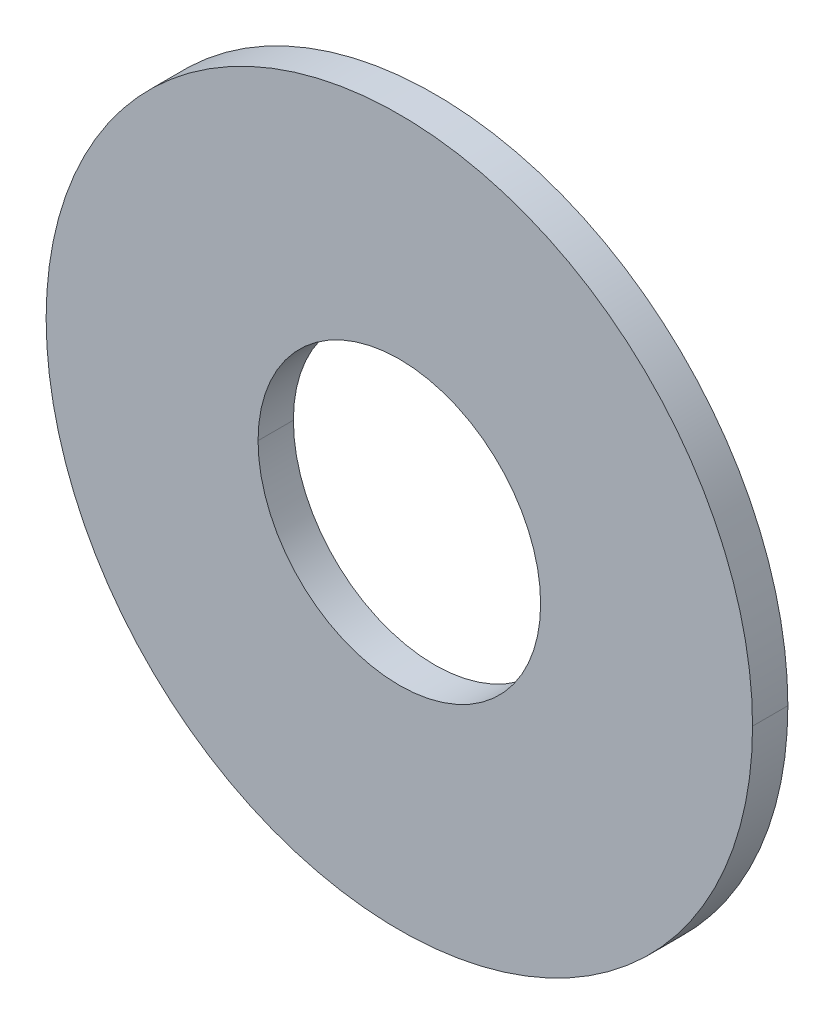
ISO-10303-21;
HEADER;
FILE_DESCRIPTION(('STEP AP214'),'2;1');
FILE_NAME('part.step','',(''),(''),'','','');
FILE_SCHEMA(('AUTOMOTIVE_DESIGN { 1 0 10303 214 1 1 1 1 }'));
ENDSEC;
DATA;
#1=APPLICATION_CONTEXT('core data for automotive mechanical design processes');
#2=APPLICATION_PROTOCOL_DEFINITION('international standard','automotive_design',2000,#1);
#3=PRODUCT_CONTEXT('',#1,'mechanical');
#4=PRODUCT('Part','Part','',(#3));
#5=PRODUCT_RELATED_PRODUCT_CATEGORY('part','',(#4));
#6=PRODUCT_DEFINITION_FORMATION('','',#4);
#7=PRODUCT_DEFINITION_CONTEXT('part definition',#1,'design');
#8=PRODUCT_DEFINITION('design','',#6,#7);
#9=PRODUCT_DEFINITION_SHAPE('','',#8);
#10=(LENGTH_UNIT() NAMED_UNIT(*) SI_UNIT(.MILLI.,.METRE.));
#11=(NAMED_UNIT(*) PLANE_ANGLE_UNIT() SI_UNIT($,.RADIAN.));
#12=(NAMED_UNIT(*) SI_UNIT($,.STERADIAN.) SOLID_ANGLE_UNIT());
#13=UNCERTAINTY_MEASURE_WITH_UNIT(LENGTH_MEASURE(1.E-05),#10,'distance_accuracy_value','');
#14=(GEOMETRIC_REPRESENTATION_CONTEXT(3) GLOBAL_UNCERTAINTY_ASSIGNED_CONTEXT((#13)) GLOBAL_UNIT_ASSIGNED_CONTEXT((#10,
#11,#12)) REPRESENTATION_CONTEXT('',''));
#15=CARTESIAN_POINT('',(0.,0.,0.));
#16=DIRECTION('',(0.,0.,1.));
#17=DIRECTION('',(1.,0.,0.));
#18=AXIS2_PLACEMENT_3D('',#15,#16,#17);
#19=CARTESIAN_POINT('',(0.,0.,1.));
#20=DIRECTION('',(0.,0.,-1.));
#21=DIRECTION('',(0.,1.,0.));
#22=AXIS2_PLACEMENT_3D('',#19,#20,#21);
#23=CYLINDRICAL_SURFACE('',#22,4.);
#24=DIRECTION('',(0.,0.,-1.));
#25=VECTOR('',#24,1.);
#26=CARTESIAN_POINT('',(4.,0.,1.));
#27=LINE('',#26,#25);
#28=CARTESIAN_POINT('',(4.,0.,1.));
#29=VERTEX_POINT('',#28);
#30=CARTESIAN_POINT('',(4.,0.,0.));
#31=VERTEX_POINT('',#30);
#32=EDGE_CURVE('E10',#29,#31,#27,.T.);
#33=ORIENTED_EDGE('',*,*,#32,.T.);
#34=CARTESIAN_POINT('',(0.,0.,0.));
#35=DIRECTION('',(0.,0.,1.));
#36=DIRECTION('',(1.,0.,0.));
#37=AXIS2_PLACEMENT_3D('',#34,#35,#36);
#38=CIRCLE('',#37,4.);
#39=CARTESIAN_POINT('',(-4.,0.,0.));
#40=VERTEX_POINT('',#39);
#41=EDGE_CURVE('E24',#40,#31,#38,.T.);
#42=ORIENTED_EDGE('',*,*,#41,.F.);
#43=DIRECTION('',(0.,0.,-1.));
#44=VECTOR('',#43,1.);
#45=CARTESIAN_POINT('',(-4.,0.,1.));
#46=LINE('',#45,#44);
#47=CARTESIAN_POINT('',(-4.,0.,1.));
#48=VERTEX_POINT('',#47);
#49=EDGE_CURVE('E93',#48,#40,#46,.T.);
#50=ORIENTED_EDGE('',*,*,#49,.F.);
#51=CARTESIAN_POINT('',(0.,0.,1.));
#52=DIRECTION('',(0.,0.,1.));
#53=DIRECTION('',(1.,0.,0.));
#54=AXIS2_PLACEMENT_3D('',#51,#52,#53);
#55=CIRCLE('',#54,4.);
#56=EDGE_CURVE('E89',#48,#29,#55,.T.);
#57=ORIENTED_EDGE('',*,*,#56,.T.);
#58=EDGE_LOOP('',(#33,#42,#50,#57));
#59=FACE_BOUND('',#58,.T.);
#60=ADVANCED_FACE('F16',(#59),#23,.F.);
#61=CARTESIAN_POINT('',(0.,0.,1.));
#62=DIRECTION('',(0.,0.,1.));
#63=DIRECTION('',(1.,0.,0.));
#64=AXIS2_PLACEMENT_3D('',#61,#62,#63);
#65=PLANE('',#64);
#66=ORIENTED_EDGE('',*,*,#56,.F.);
#67=CARTESIAN_POINT('',(0.,0.,1.));
#68=DIRECTION('',(0.,0.,1.));
#69=DIRECTION('',(1.,0.,0.));
#70=AXIS2_PLACEMENT_3D('',#67,#68,#69);
#71=CIRCLE('',#70,4.);
#72=EDGE_CURVE('E84',#29,#48,#71,.T.);
#73=ORIENTED_EDGE('',*,*,#72,.F.);
#74=EDGE_LOOP('',(#66,#73));
#75=FACE_BOUND('',#74,.T.);
#76=CARTESIAN_POINT('',(0.,0.,1.));
#77=DIRECTION('',(0.,0.,1.));
#78=DIRECTION('',(1.,0.,0.));
#79=AXIS2_PLACEMENT_3D('',#76,#77,#78);
#80=CIRCLE('',#79,10.);
#81=CARTESIAN_POINT('',(10.,0.,1.));
#82=VERTEX_POINT('',#81);
#83=CARTESIAN_POINT('',(-10.,0.,1.));
#84=VERTEX_POINT('',#83);
#85=EDGE_CURVE('E71',#82,#84,#80,.T.);
#86=ORIENTED_EDGE('',*,*,#85,.T.);
#87=CARTESIAN_POINT('',(0.,0.,1.));
#88=DIRECTION('',(0.,0.,1.));
#89=DIRECTION('',(1.,0.,0.));
#90=AXIS2_PLACEMENT_3D('',#87,#88,#89);
#91=CIRCLE('',#90,10.);
#92=EDGE_CURVE('E72',#84,#82,#91,.T.);
#93=ORIENTED_EDGE('',*,*,#92,.T.);
#94=EDGE_LOOP('',(#86,#93));
#95=FACE_BOUND('',#94,.T.);
#96=ADVANCED_FACE('F115',(#75,#95),#65,.T.);
#97=CARTESIAN_POINT('',(0.,0.,1.));
#98=DIRECTION('',(0.,0.,-1.));
#99=DIRECTION('',(0.,1.,0.));
#100=AXIS2_PLACEMENT_3D('',#97,#98,#99);
#101=CYLINDRICAL_SURFACE('',#100,10.);
#102=DIRECTION('',(0.,0.,-1.));
#103=VECTOR('',#102,1.);
#104=CARTESIAN_POINT('',(10.,0.,1.));
#105=LINE('',#104,#103);
#106=CARTESIAN_POINT('',(10.,0.,0.));
#107=VERTEX_POINT('',#106);
#108=EDGE_CURVE('E58',#82,#107,#105,.T.);
#109=ORIENTED_EDGE('',*,*,#108,.F.);
#110=ORIENTED_EDGE('',*,*,#92,.F.);
#111=DIRECTION('',(0.,0.,-1.));
#112=VECTOR('',#111,1.);
#113=CARTESIAN_POINT('',(-10.,0.,1.));
#114=LINE('',#113,#112);
#115=CARTESIAN_POINT('',(-10.,0.,0.));
#116=VERTEX_POINT('',#115);
#117=EDGE_CURVE('E60',#84,#116,#114,.T.);
#118=ORIENTED_EDGE('',*,*,#117,.T.);
#119=CARTESIAN_POINT('',(0.,0.,0.));
#120=DIRECTION('',(0.,0.,1.));
#121=DIRECTION('',(1.,0.,0.));
#122=AXIS2_PLACEMENT_3D('',#119,#120,#121);
#123=CIRCLE('',#122,10.);
#124=EDGE_CURVE('E53',#116,#107,#123,.T.);
#125=ORIENTED_EDGE('',*,*,#124,.T.);
#126=EDGE_LOOP('',(#109,#110,#118,#125));
#127=FACE_BOUND('',#126,.T.);
#128=ADVANCED_FACE('F55',(#127),#101,.T.);
#129=CARTESIAN_POINT('',(0.,0.,0.));
#130=DIRECTION('',(0.,0.,1.));
#131=DIRECTION('',(1.,0.,0.));
#132=AXIS2_PLACEMENT_3D('',#129,#130,#131);
#133=PLANE('',#132);
#134=CARTESIAN_POINT('',(0.,0.,0.));
#135=DIRECTION('',(0.,0.,1.));
#136=DIRECTION('',(1.,0.,0.));
#137=AXIS2_PLACEMENT_3D('',#134,#135,#136);
#138=CIRCLE('',#137,4.);
#139=EDGE_CURVE('E63',#31,#40,#138,.T.);
#140=ORIENTED_EDGE('',*,*,#139,.T.);
#141=ORIENTED_EDGE('',*,*,#41,.T.);
#142=EDGE_LOOP('',(#140,#141));
#143=FACE_BOUND('',#142,.T.);
#144=ORIENTED_EDGE('',*,*,#124,.F.);
#145=CARTESIAN_POINT('',(0.,0.,0.));
#146=DIRECTION('',(0.,0.,1.));
#147=DIRECTION('',(1.,0.,0.));
#148=AXIS2_PLACEMENT_3D('',#145,#146,#147);
#149=CIRCLE('',#148,10.);
#150=EDGE_CURVE('E65',#107,#116,#149,.T.);
#151=ORIENTED_EDGE('',*,*,#150,.F.);
#152=EDGE_LOOP('',(#144,#151));
#153=FACE_BOUND('',#152,.T.);
#154=ADVANCED_FACE('F66',(#143,#153),#133,.F.);
#155=CARTESIAN_POINT('',(0.,0.,1.));
#156=DIRECTION('',(0.,0.,-1.));
#157=DIRECTION('',(0.,-1.,0.));
#158=AXIS2_PLACEMENT_3D('',#155,#156,#157);
#159=CYLINDRICAL_SURFACE('',#158,10.);
#160=ORIENTED_EDGE('',*,*,#108,.T.);
#161=ORIENTED_EDGE('',*,*,#150,.T.);
#162=ORIENTED_EDGE('',*,*,#117,.F.);
#163=ORIENTED_EDGE('',*,*,#85,.F.);
#164=EDGE_LOOP('',(#160,#161,#162,#163));
#165=FACE_BOUND('',#164,.T.);
#166=ADVANCED_FACE('F70',(#165),#159,.T.);
#167=CARTESIAN_POINT('',(0.,0.,1.));
#168=DIRECTION('',(0.,0.,-1.));
#169=DIRECTION('',(0.,-1.,0.));
#170=AXIS2_PLACEMENT_3D('',#167,#168,#169);
#171=CYLINDRICAL_SURFACE('',#170,4.);
#172=ORIENTED_EDGE('',*,*,#32,.F.);
#173=ORIENTED_EDGE('',*,*,#72,.T.);
#174=ORIENTED_EDGE('',*,*,#49,.T.);
#175=ORIENTED_EDGE('',*,*,#139,.F.);
#176=EDGE_LOOP('',(#172,#173,#174,#175));
#177=FACE_BOUND('',#176,.T.);
#178=ADVANCED_FACE('F111',(#177),#171,.F.);
#179=CLOSED_SHELL('',(#60,#96,#128,#154,#166,#178));
#180=MANIFOLD_SOLID_BREP('B1',#179);
#181=ADVANCED_BREP_SHAPE_REPRESENTATION('',(#18,#180),#14);
#182=SHAPE_DEFINITION_REPRESENTATION(#9,#181);
ENDSEC;
END-ISO-10303-21;
